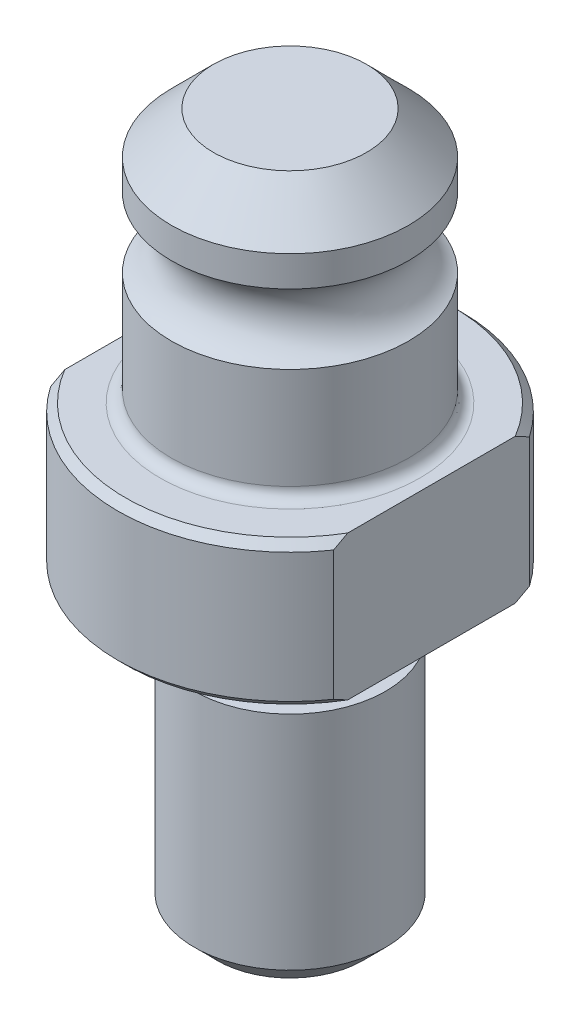
ISO-10303-21;
HEADER;
FILE_DESCRIPTION(('STEP AP214'),'2;1');
FILE_NAME('part.step','',(''),(''),'','','');
FILE_SCHEMA(('AUTOMOTIVE_DESIGN { 1 0 10303 214 1 1 1 1 }'));
ENDSEC;
DATA;
#1=APPLICATION_CONTEXT('core data for automotive mechanical design processes');
#2=APPLICATION_PROTOCOL_DEFINITION('international standard','automotive_design',2000,#1);
#3=PRODUCT_CONTEXT('',#1,'mechanical');
#4=PRODUCT('Part','Part','',(#3));
#5=PRODUCT_RELATED_PRODUCT_CATEGORY('part','',(#4));
#6=PRODUCT_DEFINITION_FORMATION('','',#4);
#7=PRODUCT_DEFINITION_CONTEXT('part definition',#1,'design');
#8=PRODUCT_DEFINITION('design','',#6,#7);
#9=PRODUCT_DEFINITION_SHAPE('','',#8);
#10=(LENGTH_UNIT() NAMED_UNIT(*) SI_UNIT(.MILLI.,.METRE.));
#11=(NAMED_UNIT(*) PLANE_ANGLE_UNIT() SI_UNIT($,.RADIAN.));
#12=(NAMED_UNIT(*) SI_UNIT($,.STERADIAN.) SOLID_ANGLE_UNIT());
#13=UNCERTAINTY_MEASURE_WITH_UNIT(LENGTH_MEASURE(1.E-05),#10,'distance_accuracy_value','');
#14=(GEOMETRIC_REPRESENTATION_CONTEXT(3) GLOBAL_UNCERTAINTY_ASSIGNED_CONTEXT((#13)) GLOBAL_UNIT_ASSIGNED_CONTEXT((#10,
#11,#12)) REPRESENTATION_CONTEXT('',''));
#15=CARTESIAN_POINT('',(0.,0.,0.));
#16=DIRECTION('',(0.,0.,1.));
#17=DIRECTION('',(1.,0.,0.));
#18=AXIS2_PLACEMENT_3D('',#15,#16,#17);
#19=CARTESIAN_POINT('',(0.,-20.066,0.));
#20=DIRECTION('',(0.,1.,0.));
#21=DIRECTION('',(-1.,0.,0.));
#22=AXIS2_PLACEMENT_3D('',#19,#20,#21);
#23=CYLINDRICAL_SURFACE('',#22,11.43);
#24=DIRECTION('',(0.,1.,0.));
#25=VECTOR('',#24,1.);
#26=CARTESIAN_POINT('',(-9.398,-20.066,-6.50557422523177));
#27=LINE('',#26,#25);
#28=CARTESIAN_POINT('',(-9.398,0.507999999999992,-6.50557422523177));
#29=VERTEX_POINT('',#28);
#30=CARTESIAN_POINT('',(-9.398,9.09319999999999,-6.50557422523177));
#31=VERTEX_POINT('',#30);
#32=EDGE_CURVE('E178',#29,#31,#27,.T.);
#33=ORIENTED_EDGE('',*,*,#32,.T.);
#34=CARTESIAN_POINT('',(0.,9.09319999999999,0.));
#35=DIRECTION('',(0.,1.,0.));
#36=DIRECTION('',(-1.,0.,0.));
#37=AXIS2_PLACEMENT_3D('',#34,#35,#36);
#38=CIRCLE('',#37,11.43);
#39=CARTESIAN_POINT('',(9.398,9.09319999999999,-6.50557422523177));
#40=VERTEX_POINT('',#39);
#41=EDGE_CURVE('E196',#31,#40,#38,.F.);
#42=ORIENTED_EDGE('',*,*,#41,.T.);
#43=DIRECTION('',(0.,1.,0.));
#44=VECTOR('',#43,1.);
#45=CARTESIAN_POINT('',(9.398,-20.066,-6.50557422523177));
#46=LINE('',#45,#44);
#47=CARTESIAN_POINT('',(9.398,0.507999999999991,-6.50557422523177));
#48=VERTEX_POINT('',#47);
#49=EDGE_CURVE('E158',#48,#40,#46,.T.);
#50=ORIENTED_EDGE('',*,*,#49,.F.);
#51=CARTESIAN_POINT('',(0.,0.507999999999991,0.));
#52=DIRECTION('',(0.,-1.,0.));
#53=DIRECTION('',(1.,0.,0.));
#54=AXIS2_PLACEMENT_3D('',#51,#52,#53);
#55=CIRCLE('',#54,11.43);
#56=EDGE_CURVE('E199',#48,#29,#55,.F.);
#57=ORIENTED_EDGE('',*,*,#56,.T.);
#58=EDGE_LOOP('',(#33,#42,#50,#57));
#59=FACE_BOUND('',#58,.T.);
#60=ADVANCED_FACE('F31',(#59),#23,.T.);
#61=CARTESIAN_POINT('',(0.,0.507999999999991,0.));
#62=DIRECTION('',(0.,1.,0.));
#63=DIRECTION('',(-1.,0.,0.));
#64=AXIS2_PLACEMENT_3D('',#61,#62,#63);
#65=CONICAL_SURFACE('',#64,11.43,0.785398163397452);
#66=CARTESIAN_POINT('',(-9.398,6.20515109767811,-14.3184112499501));
#67=CARTESIAN_POINT('',(-9.398,6.00960417319241,-14.08449094914));
#68=CARTESIAN_POINT('',(-9.398,5.81489107595651,-13.8498698562992));
#69=CARTESIAN_POINT('',(-9.398,5.42739573795378,-13.3790258088407));
#70=CARTESIAN_POINT('',(-9.398,5.23461356289662,-13.1428028001653));
#71=CARTESIAN_POINT('',(-9.398,4.8511079654793,-12.6683866504166));
#72=CARTESIAN_POINT('',(-9.398,4.66038625512613,-12.4301921239068));
#73=CARTESIAN_POINT('',(-9.398,4.28149353308532,-11.9517843820013));
#74=CARTESIAN_POINT('',(-9.398,4.09332250005509,-11.7115711835239));
#75=CARTESIAN_POINT('',(-9.398,3.71527593658798,-11.2228351276237));
#76=CARTESIAN_POINT('',(-9.398,3.52547501990412,-10.9742544794526));
#77=CARTESIAN_POINT('',(-9.398,3.14951118909463,-10.4743575593104));
#78=CARTESIAN_POINT('',(-9.398,2.9633482309098,-10.2230413205276));
#79=CARTESIAN_POINT('',(-9.398,2.59536564911707,-9.71734764233813));
#80=CARTESIAN_POINT('',(-9.398,2.41354486426719,-9.46297104936886));
#81=CARTESIAN_POINT('',(-9.398,2.05501231016234,-8.9506393803597));
#82=CARTESIAN_POINT('',(-9.398,1.87830044330885,-8.69268437281977));
#83=CARTESIAN_POINT('',(-9.398,1.56456912546989,-8.22291682969296));
#84=CARTESIAN_POINT('',(-9.398,1.42647837425502,-8.0118204649176));
#85=CARTESIAN_POINT('',(-9.398,1.15495905884282,-7.58665310777869));
#86=CARTESIAN_POINT('',(-9.398,1.02153034058384,-7.37258221403886));
#87=CARTESIAN_POINT('',(-9.398,0.760058312603229,-6.94100654824664));
#88=CARTESIAN_POINT('',(-9.398,0.632017983088299,-6.72349996511674));
#89=CARTESIAN_POINT('',(-9.398,0.382380030476805,-6.28483366169819));
#90=CARTESIAN_POINT('',(-9.398,0.260781926304037,-6.06367421581125));
#91=CARTESIAN_POINT('',(-9.398,0.0260310883673295,-5.61893125793485));
#92=CARTESIAN_POINT('',(-9.398,-0.087176390474475,-5.39537686735325));
#93=CARTESIAN_POINT('',(-9.398,-0.304724231527306,-4.94401149584156));
#94=CARTESIAN_POINT('',(-9.398,-0.409064064653849,-4.71620026191648));
#95=CARTESIAN_POINT('',(-9.398,-0.706245204543078,-4.02633645713959));
#96=CARTESIAN_POINT('',(-9.398,-0.88357135735487,-3.55725866273005));
#97=CARTESIAN_POINT('',(-9.398,-1.11925927572375,-2.80027581270136));
#98=CARTESIAN_POINT('',(-9.398,-1.19642089442063,-2.51819409135615));
#99=CARTESIAN_POINT('',(-9.398,-1.32808067194305,-1.94872920659047));
#100=CARTESIAN_POINT('',(-9.398,-1.38258192179547,-1.6613467718119));
#101=CARTESIAN_POINT('',(-9.398,-1.46601585472433,-1.08377451088637));
#102=CARTESIAN_POINT('',(-9.398,-1.49502921597881,-0.793596503905189));
#103=CARTESIAN_POINT('',(-9.398,-1.52610154719579,-0.211784175224561));
#104=CARTESIAN_POINT('',(-9.398,-1.5281614920139,0.0798500934229162));
#105=CARTESIAN_POINT('',(-9.398,-1.50520012960554,0.662106927066459));
#106=CARTESIAN_POINT('',(-9.398,-1.48017181460068,0.952729210743102));
#107=CARTESIAN_POINT('',(-9.398,-1.40449019133301,1.5305913863711));
#108=CARTESIAN_POINT('',(-9.398,-1.35383429003577,1.81783093304246));
#109=CARTESIAN_POINT('',(-9.398,-1.22928523711488,2.38834337894052));
#110=CARTESIAN_POINT('',(-9.398,-1.15530115653646,2.67159614677237));
#111=CARTESIAN_POINT('',(-9.398,-0.987366205247122,3.23203762715996));
#112=CARTESIAN_POINT('',(-9.398,-0.893415412990204,3.50922636353801));
#113=CARTESIAN_POINT('',(-9.398,-0.666567865395263,4.11670181718503));
#114=CARTESIAN_POINT('',(-9.398,-0.529643444923908,4.44547461397256));
#115=CARTESIAN_POINT('',(-9.398,-0.236065659034477,5.09416537719402));
#116=CARTESIAN_POINT('',(-9.398,-0.0794024617509457,5.41407883325828));
#117=CARTESIAN_POINT('',(-9.398,0.249748723060986,6.04636729869469));
#118=CARTESIAN_POINT('',(-9.398,0.422266185337797,6.35872684553366));
#119=CARTESIAN_POINT('',(-9.398,0.779573669101482,6.97623166997071));
#120=CARTESIAN_POINT('',(-9.398,0.964361731892766,7.28137808847071));
#121=CARTESIAN_POINT('',(-9.398,1.34493065893927,7.88740298676278));
#122=CARTESIAN_POINT('',(-9.398,1.54077367051226,8.18824225449228));
#123=CARTESIAN_POINT('',(-9.398,1.9404315326033,8.7845713773197));
#124=CARTESIAN_POINT('',(-9.398,2.14424663514559,9.0800610628669));
#125=CARTESIAN_POINT('',(-9.398,2.55813820898903,9.66616342017784));
#126=CARTESIAN_POINT('',(-9.398,2.76820817435713,9.95678069963848));
#127=CARTESIAN_POINT('',(-9.398,3.19364561900608,10.5340926145833));
#128=CARTESIAN_POINT('',(-9.398,3.40901297979698,10.8207873375829));
#129=CARTESIAN_POINT('',(-9.398,3.83603479433634,11.380184094233));
#130=CARTESIAN_POINT('',(-9.398,4.04752824782697,11.6530092675254));
#131=CARTESIAN_POINT('',(-9.398,4.47398108014071,12.1959852761766));
#132=CARTESIAN_POINT('',(-9.398,4.6889408592987,12.4661357967328));
#133=CARTESIAN_POINT('',(-9.398,5.11939580741512,13.0011138143318));
#134=CARTESIAN_POINT('',(-9.398,5.33485890307148,13.2659671556663));
#135=CARTESIAN_POINT('',(-9.398,5.76825166907075,13.7936425802487));
#136=CARTESIAN_POINT('',(-9.398,5.98618130385707,14.0564646926862));
#137=CARTESIAN_POINT('',(-9.398,6.20515109767811,14.3184112499501));
#138=B_SPLINE_CURVE_WITH_KNOTS('',3,(#66,#67,#68,#69,#70,#71,#72,#73,#74,#75,#76,#77,#78,#79,
#80,#81,#82,#83,#84,#85,#86,#87,#88,#89,#90,#91,#92,#93,#94,#95,#96,#97,#98,#99,#100,#101,#102,
#103,#104,#105,#106,#107,#108,#109,#110,#111,#112,#113,#114,#115,#116,#117,#118,#119,#120,#121,
#122,#123,#124,#125,#126,#127,#128,#129,#130,#131,#132,#133,#134,#135,#136,#137),.UNSPECIFIED.,
.F.,.F.,(4,2,2,2,2,2,2,2,2,2,2,2,2,2,2,2,2,2,2,2,2,2,2,2,2,2,2,2,2,2,2,2,2,2,2,4),(0.,
0.914669348864225,1.82936971906776,2.74477924736894,3.66018111132055,4.59842273117614,
5.53665298096529,6.47462944133687,7.41258797116341,8.1692907672537,8.92596853362805,
9.68305944557016,10.4400937414729,11.1916499993646,11.9432510671212,13.4444271153923,
14.3210100831176,15.1974734397647,16.0711523786463,16.9447997180765,17.8186731255787,
18.6926349704834,19.5700463690559,20.447454320132,21.5150460059722,22.5831715761537,
23.6533247053991,24.7233074201033,25.8000590624781,26.8768447720971,27.9525471178122,
29.0282254245012,30.0637937125213,31.0994824699716,32.1237444894033,33.1479917622709),.UNSPECIFIED.);
#139=CARTESIAN_POINT('',(-9.398,0.,-5.56486118425249));
#140=VERTEX_POINT('',#139);
#141=EDGE_CURVE('E179',#29,#140,#138,.T.);
#142=ORIENTED_EDGE('',*,*,#141,.F.);
#143=ORIENTED_EDGE('',*,*,#56,.F.);
#144=CARTESIAN_POINT('',(9.398,6.20515109767811,14.3184112499501));
#145=CARTESIAN_POINT('',(9.398,6.00960417319241,14.08449094914));
#146=CARTESIAN_POINT('',(9.398,5.81489107595651,13.8498698562992));
#147=CARTESIAN_POINT('',(9.398,5.42739573795378,13.3790258088408));
#148=CARTESIAN_POINT('',(9.398,5.23461356289662,13.1428028001653));
#149=CARTESIAN_POINT('',(9.398,4.8511079654793,12.6683866504166));
#150=CARTESIAN_POINT('',(9.398,4.66038625512613,12.4301921239068));
#151=CARTESIAN_POINT('',(9.398,4.28149353308532,11.9517843820013));
#152=CARTESIAN_POINT('',(9.398,4.09332250005509,11.7115711835239));
#153=CARTESIAN_POINT('',(9.398,3.71527593658798,11.2228351276237));
#154=CARTESIAN_POINT('',(9.398,3.52547501990412,10.9742544794526));
#155=CARTESIAN_POINT('',(9.398,3.14951118909463,10.4743575593104));
#156=CARTESIAN_POINT('',(9.398,2.9633482309098,10.2230413205276));
#157=CARTESIAN_POINT('',(9.398,2.59536564911707,9.71734764233813));
#158=CARTESIAN_POINT('',(9.398,2.41354486426719,9.46297104936886));
#159=CARTESIAN_POINT('',(9.398,2.05501231016234,8.95063938035971));
#160=CARTESIAN_POINT('',(9.398,1.87830044330885,8.69268437281978));
#161=CARTESIAN_POINT('',(9.398,1.56456912546989,8.22291682969296));
#162=CARTESIAN_POINT('',(9.398,1.42647837425502,8.0118204649176));
#163=CARTESIAN_POINT('',(9.398,1.15495905884282,7.58665310777869));
#164=CARTESIAN_POINT('',(9.398,1.02153034058384,7.37258221403886));
#165=CARTESIAN_POINT('',(9.398,0.760058312603227,6.94100654824664));
#166=CARTESIAN_POINT('',(9.398,0.632017983088297,6.72349996511674));
#167=CARTESIAN_POINT('',(9.398,0.382380030476802,6.28483366169819));
#168=CARTESIAN_POINT('',(9.398,0.260781926304033,6.06367421581125));
#169=CARTESIAN_POINT('',(9.398,0.0260310883673268,5.61893125793485));
#170=CARTESIAN_POINT('',(9.398,-0.087176390474476,5.39537686735325));
#171=CARTESIAN_POINT('',(9.398,-0.304724231527307,4.94401149584156));
#172=CARTESIAN_POINT('',(9.398,-0.409064064653852,4.71620026191648));
#173=CARTESIAN_POINT('',(9.398,-0.706245204543083,4.02633645713959));
#174=CARTESIAN_POINT('',(9.398,-0.883571357354872,3.55725866273005));
#175=CARTESIAN_POINT('',(9.398,-1.11925927572375,2.80027581270135));
#176=CARTESIAN_POINT('',(9.398,-1.19642089442063,2.51819409135615));
#177=CARTESIAN_POINT('',(9.398,-1.32808067194305,1.94872920659046));
#178=CARTESIAN_POINT('',(9.398,-1.38258192179547,1.6613467718119));
#179=CARTESIAN_POINT('',(9.398,-1.46601585472434,1.08377451088637));
#180=CARTESIAN_POINT('',(9.398,-1.49502921597882,0.793596503905186));
#181=CARTESIAN_POINT('',(9.398,-1.52610154719579,0.211784175224558));
#182=CARTESIAN_POINT('',(9.398,-1.5281614920139,-0.079850093422919));
#183=CARTESIAN_POINT('',(9.398,-1.50520012960554,-0.662106927066461));
#184=CARTESIAN_POINT('',(9.398,-1.48017181460068,-0.952729210743103));
#185=CARTESIAN_POINT('',(9.398,-1.40449019133301,-1.5305913863711));
#186=CARTESIAN_POINT('',(9.398,-1.35383429003577,-1.81783093304246));
#187=CARTESIAN_POINT('',(9.398,-1.22928523711488,-2.38834337894052));
#188=CARTESIAN_POINT('',(9.398,-1.15530115653647,-2.67159614677237));
#189=CARTESIAN_POINT('',(9.398,-0.987366205247123,-3.23203762715996));
#190=CARTESIAN_POINT('',(9.398,-0.893415412990204,-3.50922636353801));
#191=CARTESIAN_POINT('',(9.398,-0.666567865395263,-4.11670181718503));
#192=CARTESIAN_POINT('',(9.398,-0.529643444923908,-4.44547461397257));
#193=CARTESIAN_POINT('',(9.398,-0.236065659034477,-5.09416537719403));
#194=CARTESIAN_POINT('',(9.398,-0.079402461750945,-5.41407883325829));
#195=CARTESIAN_POINT('',(9.398,0.249748723060989,-6.04636729869469));
#196=CARTESIAN_POINT('',(9.398,0.422266185337801,-6.35872684553367));
#197=CARTESIAN_POINT('',(9.398,0.779573669101487,-6.97623166997072));
#198=CARTESIAN_POINT('',(9.398,0.96436173189277,-7.28137808847072));
#199=CARTESIAN_POINT('',(9.398,1.34493065893928,-7.88740298676279));
#200=CARTESIAN_POINT('',(9.398,1.54077367051226,-8.18824225449229));
#201=CARTESIAN_POINT('',(9.398,1.94043153260331,-8.78457137731971));
#202=CARTESIAN_POINT('',(9.398,2.14424663514559,-9.08006106286691));
#203=CARTESIAN_POINT('',(9.398,2.55813820898904,-9.66616342017786));
#204=CARTESIAN_POINT('',(9.398,2.76820817435714,-9.95678069963849));
#205=CARTESIAN_POINT('',(9.398,3.19364561900609,-10.5340926145834));
#206=CARTESIAN_POINT('',(9.398,3.409012979797,-10.8207873375829));
#207=CARTESIAN_POINT('',(9.398,3.83603479433635,-11.380184094233));
#208=CARTESIAN_POINT('',(9.398,4.04752824782698,-11.6530092675254));
#209=CARTESIAN_POINT('',(9.398,4.47398108014072,-12.1959852761766));
#210=CARTESIAN_POINT('',(9.398,4.68894085929871,-12.4661357967328));
#211=CARTESIAN_POINT('',(9.398,5.11939580741512,-13.0011138143318));
#212=CARTESIAN_POINT('',(9.398,5.33485890307149,-13.2659671556663));
#213=CARTESIAN_POINT('',(9.398,5.76825166907074,-13.7936425802487));
#214=CARTESIAN_POINT('',(9.398,5.98618130385707,-14.0564646926862));
#215=CARTESIAN_POINT('',(9.398,6.20515109767811,-14.3184112499501));
#216=B_SPLINE_CURVE_WITH_KNOTS('',3,(#144,#145,#146,#147,#148,#149,#150,#151,#152,#153,#154,
#155,#156,#157,#158,#159,#160,#161,#162,#163,#164,#165,#166,#167,#168,#169,#170,#171,#172,#173,
#174,#175,#176,#177,#178,#179,#180,#181,#182,#183,#184,#185,#186,#187,#188,#189,#190,#191,#192,
#193,#194,#195,#196,#197,#198,#199,#200,#201,#202,#203,#204,#205,#206,#207,#208,#209,#210,#211,
#212,#213,#214,#215),.UNSPECIFIED.,.F.,.F.,(4,2,2,2,2,2,2,2,2,2,2,2,2,2,2,2,2,2,2,2,2,2,2,2,2,2,
2,2,2,2,2,2,2,2,2,4),(0.,0.914669348864223,1.82936971906776,2.74477924736894,3.66018111132055,
4.59842273117614,5.5366529809653,6.47462944133688,7.41258797116341,8.1692907672537,
8.92596853362805,9.68305944557017,10.4400937414729,11.1916499993646,11.9432510671212,
13.4444271153923,14.3210100831176,15.1974734397647,16.0711523786463,16.9447997180765,
17.8186731255787,18.6926349704834,19.5700463690559,20.447454320132,21.5150460059722,
22.5831715761537,23.6533247053991,24.7233074201033,25.8000590624781,26.8768447720972,
27.9525471178122,29.0282254245012,30.0637937125213,31.0994824699716,32.1237444894033,
33.1479917622709),.UNSPECIFIED.);
#217=CARTESIAN_POINT('',(9.398,0.,-5.5648611842525));
#218=VERTEX_POINT('',#217);
#219=EDGE_CURVE('E149',#218,#48,#216,.T.);
#220=ORIENTED_EDGE('',*,*,#219,.F.);
#221=CARTESIAN_POINT('',(0.,0.,0.));
#222=DIRECTION('',(0.,-1.,0.));
#223=DIRECTION('',(1.,0.,0.));
#224=AXIS2_PLACEMENT_3D('',#221,#222,#223);
#225=CIRCLE('',#224,10.922);
#226=EDGE_CURVE('E116',#140,#218,#225,.T.);
#227=ORIENTED_EDGE('',*,*,#226,.F.);
#228=EDGE_LOOP('',(#142,#143,#220,#227));
#229=FACE_BOUND('',#228,.T.);
#230=ADVANCED_FACE('F166',(#229),#65,.T.);
#231=CARTESIAN_POINT('',(0.,9.6012,0.));
#232=DIRECTION('',(0.,-1.,0.));
#233=DIRECTION('',(1.,0.,0.));
#234=AXIS2_PLACEMENT_3D('',#231,#232,#233);
#235=CONICAL_SURFACE('',#234,10.922,0.785398163397453);
#236=CARTESIAN_POINT('',(-9.398,3.39604890232189,14.3184112499501));
#237=CARTESIAN_POINT('',(-9.398,3.59159582680758,14.08449094914));
#238=CARTESIAN_POINT('',(-9.398,3.78630892404348,13.8498698562992));
#239=CARTESIAN_POINT('',(-9.398,4.17380426204621,13.3790258088407));
#240=CARTESIAN_POINT('',(-9.398,4.36658643710338,13.1428028001653));
#241=CARTESIAN_POINT('',(-9.398,4.75009203452069,12.6683866504166));
#242=CARTESIAN_POINT('',(-9.398,4.94081374487387,12.4301921239068));
#243=CARTESIAN_POINT('',(-9.398,5.31970646691468,11.9517843820013));
#244=CARTESIAN_POINT('',(-9.398,5.5078774999449,11.7115711835239));
#245=CARTESIAN_POINT('',(-9.398,5.88592406341201,11.2228351276237));
#246=CARTESIAN_POINT('',(-9.398,6.07572498009587,10.9742544794526));
#247=CARTESIAN_POINT('',(-9.398,6.45168881090536,10.4743575593104));
#248=CARTESIAN_POINT('',(-9.398,6.6378517690902,10.2230413205276));
#249=CARTESIAN_POINT('',(-9.398,7.00583435088292,9.71734764233812));
#250=CARTESIAN_POINT('',(-9.398,7.1876551357328,9.46297104936885));
#251=CARTESIAN_POINT('',(-9.398,7.54618768983765,8.9506393803597));
#252=CARTESIAN_POINT('',(-9.398,7.72289955669114,8.69268437281977));
#253=CARTESIAN_POINT('',(-9.398,8.0366308745301,8.22291682969295));
#254=CARTESIAN_POINT('',(-9.398,8.17472162574497,8.01182046491759));
#255=CARTESIAN_POINT('',(-9.398,8.44624094115716,7.58665310777868));
#256=CARTESIAN_POINT('',(-9.398,8.57966965941615,7.37258221403885));
#257=CARTESIAN_POINT('',(-9.398,8.84114168739676,6.94100654824664));
#258=CARTESIAN_POINT('',(-9.398,8.96918201691169,6.72349996511673));
#259=CARTESIAN_POINT('',(-9.398,9.21881996952318,6.28483366169818));
#260=CARTESIAN_POINT('',(-9.398,9.34041807369595,6.06367421581125));
#261=CARTESIAN_POINT('',(-9.398,9.57516891163265,5.61893125793484));
#262=CARTESIAN_POINT('',(-9.398,9.68837639047446,5.39537686735324));
#263=CARTESIAN_POINT('',(-9.398,9.90592423152729,4.94401149584155));
#264=CARTESIAN_POINT('',(-9.398,10.0102640646538,4.71620026191647));
#265=CARTESIAN_POINT('',(-9.398,10.3074452045431,4.02633645713958));
#266=CARTESIAN_POINT('',(-9.398,10.4847713573548,3.55725866273004));
#267=CARTESIAN_POINT('',(-9.398,10.7204592757237,2.80027581270134));
#268=CARTESIAN_POINT('',(-9.398,10.7976208944206,2.51819409135613));
#269=CARTESIAN_POINT('',(-9.398,10.929280671943,1.94872920659045));
#270=CARTESIAN_POINT('',(-9.398,10.9837819217954,1.66134677181189));
#271=CARTESIAN_POINT('',(-9.398,11.0672158547243,1.08377451088635));
#272=CARTESIAN_POINT('',(-9.398,11.0962292159788,0.793596503905169));
#273=CARTESIAN_POINT('',(-9.398,11.1273015471958,0.211784175224539));
#274=CARTESIAN_POINT('',(-9.398,11.1293614920139,-0.0798500934229388));
#275=CARTESIAN_POINT('',(-9.398,11.1064001296055,-0.662106927066483));
#276=CARTESIAN_POINT('',(-9.398,11.0813718146007,-0.952729210743125));
#277=CARTESIAN_POINT('',(-9.398,11.005690191333,-1.53059138637113));
#278=CARTESIAN_POINT('',(-9.398,10.9550342900357,-1.81783093304248));
#279=CARTESIAN_POINT('',(-9.398,10.8304852371148,-2.38834337894055));
#280=CARTESIAN_POINT('',(-9.398,10.7565011565364,-2.6715961467724));
#281=CARTESIAN_POINT('',(-9.398,10.5885662052471,-3.23203762715999));
#282=CARTESIAN_POINT('',(-9.398,10.4946154129902,-3.50922636353804));
#283=CARTESIAN_POINT('',(-9.398,10.2677678653952,-4.11670181718506));
#284=CARTESIAN_POINT('',(-9.398,10.1308434449239,-4.4454746139726));
#285=CARTESIAN_POINT('',(-9.398,9.83726565903443,-5.09416537719407));
#286=CARTESIAN_POINT('',(-9.398,9.6806024617509,-5.41407883325834));
#287=CARTESIAN_POINT('',(-9.398,9.35145127693896,-6.04636729869475));
#288=CARTESIAN_POINT('',(-9.398,9.17893381466214,-6.35872684553373));
#289=CARTESIAN_POINT('',(-9.398,8.82162633089846,-6.97623166997078));
#290=CARTESIAN_POINT('',(-9.398,8.63683826810717,-7.28137808847079));
#291=CARTESIAN_POINT('',(-9.398,8.25626934106066,-7.88740298676286));
#292=CARTESIAN_POINT('',(-9.398,8.06042632948767,-8.18824225449236));
#293=CARTESIAN_POINT('',(-9.398,7.66076846739662,-8.78457137731979));
#294=CARTESIAN_POINT('',(-9.398,7.45695336485433,-9.08006106286699));
#295=CARTESIAN_POINT('',(-9.398,7.04306179101088,-9.66616342017794));
#296=CARTESIAN_POINT('',(-9.398,6.83299182564279,-9.95678069963858));
#297=CARTESIAN_POINT('',(-9.398,6.40755438099382,-10.5340926145835));
#298=CARTESIAN_POINT('',(-9.398,6.19218702020292,-10.820787337583));
#299=CARTESIAN_POINT('',(-9.398,5.76516520566357,-11.3801840942331));
#300=CARTESIAN_POINT('',(-9.398,5.55367175217295,-11.6530092675255));
#301=CARTESIAN_POINT('',(-9.398,5.12721891985922,-12.1959852761767));
#302=CARTESIAN_POINT('',(-9.398,4.91225914070125,-12.4661357967329));
#303=CARTESIAN_POINT('',(-9.398,4.48180419258484,-13.0011138143318));
#304=CARTESIAN_POINT('',(-9.398,4.26634109692848,-13.2659671556664));
#305=CARTESIAN_POINT('',(-9.398,3.83294833092923,-13.7936425802488));
#306=CARTESIAN_POINT('',(-9.398,3.61501869614292,-14.0564646926862));
#307=CARTESIAN_POINT('',(-9.398,3.39604890232189,-14.3184112499501));
#308=B_SPLINE_CURVE_WITH_KNOTS('',3,(#236,#237,#238,#239,#240,#241,#242,#243,#244,#245,#246,
#247,#248,#249,#250,#251,#252,#253,#254,#255,#256,#257,#258,#259,#260,#261,#262,#263,#264,#265,
#266,#267,#268,#269,#270,#271,#272,#273,#274,#275,#276,#277,#278,#279,#280,#281,#282,#283,#284,
#285,#286,#287,#288,#289,#290,#291,#292,#293,#294,#295,#296,#297,#298,#299,#300,#301,#302,#303,
#304,#305,#306,#307),.UNSPECIFIED.,.F.,.F.,(4,2,2,2,2,2,2,2,2,2,2,2,2,2,2,2,2,2,2,2,2,2,2,2,2,2,
2,2,2,2,2,2,2,2,2,4),(0.,0.914669348864224,1.82936971906776,2.74477924736894,3.66018111132055,
4.59842273117614,5.5366529809653,6.47462944133688,7.41258797116341,8.16929076725369,
8.92596853362805,9.68305944557016,10.4400937414729,11.1916499993646,11.9432510671212,
13.4444271153923,14.3210100831176,15.1974734397647,16.0711523786463,16.9447997180766,
17.8186731255788,18.6926349704834,19.5700463690559,20.447454320132,21.5150460059722,
22.5831715761537,23.6533247053991,24.7233074201033,25.8000590624782,26.8768447720972,
27.9525471178123,29.0282254245013,30.0637937125214,31.0994824699716,32.1237444894033,
33.1479917622709),.UNSPECIFIED.);
#309=CARTESIAN_POINT('',(-9.398,9.09319999999999,6.50557422523177));
#310=VERTEX_POINT('',#309);
#311=CARTESIAN_POINT('',(-9.398,9.6012,5.56486118425246));
#312=VERTEX_POINT('',#311);
#313=EDGE_CURVE('E95',#310,#312,#308,.T.);
#314=ORIENTED_EDGE('',*,*,#313,.F.);
#315=CARTESIAN_POINT('',(9.398,9.09319999999999,6.50557422523177));
#316=VERTEX_POINT('',#315);
#317=EDGE_CURVE('E202',#316,#310,#38,.F.);
#318=ORIENTED_EDGE('',*,*,#317,.F.);
#319=CARTESIAN_POINT('',(9.398,3.39604890232189,-14.3184112499501));
#320=CARTESIAN_POINT('',(9.398,3.59159582680758,-14.08449094914));
#321=CARTESIAN_POINT('',(9.398,3.78630892404348,-13.8498698562992));
#322=CARTESIAN_POINT('',(9.398,4.17380426204621,-13.3790258088408));
#323=CARTESIAN_POINT('',(9.398,4.36658643710338,-13.1428028001653));
#324=CARTESIAN_POINT('',(9.398,4.75009203452069,-12.6683866504166));
#325=CARTESIAN_POINT('',(9.398,4.94081374487386,-12.4301921239068));
#326=CARTESIAN_POINT('',(9.398,5.31970646691467,-11.9517843820013));
#327=CARTESIAN_POINT('',(9.398,5.5078774999449,-11.7115711835239));
#328=CARTESIAN_POINT('',(9.398,5.88592406341201,-11.2228351276237));
#329=CARTESIAN_POINT('',(9.398,6.07572498009587,-10.9742544794526));
#330=CARTESIAN_POINT('',(9.398,6.45168881090536,-10.4743575593104));
#331=CARTESIAN_POINT('',(9.398,6.63785176909019,-10.2230413205276));
#332=CARTESIAN_POINT('',(9.398,7.00583435088292,-9.71734764233813));
#333=CARTESIAN_POINT('',(9.398,7.1876551357328,-9.46297104936886));
#334=CARTESIAN_POINT('',(9.398,7.54618768983765,-8.9506393803597));
#335=CARTESIAN_POINT('',(9.398,7.72289955669114,-8.69268437281977));
#336=CARTESIAN_POINT('',(9.398,8.0366308745301,-8.22291682969295));
#337=CARTESIAN_POINT('',(9.398,8.17472162574497,-8.01182046491759));
#338=CARTESIAN_POINT('',(9.398,8.44624094115716,-7.58665310777868));
#339=CARTESIAN_POINT('',(9.398,8.57966965941615,-7.37258221403886));
#340=CARTESIAN_POINT('',(9.398,8.84114168739676,-6.94100654824664));
#341=CARTESIAN_POINT('',(9.398,8.96918201691169,-6.72349996511673));
#342=CARTESIAN_POINT('',(9.398,9.21881996952318,-6.28483366169818));
#343=CARTESIAN_POINT('',(9.398,9.34041807369595,-6.06367421581125));
#344=CARTESIAN_POINT('',(9.398,9.57516891163266,-5.61893125793484));
#345=CARTESIAN_POINT('',(9.398,9.68837639047446,-5.39537686735324));
#346=CARTESIAN_POINT('',(9.398,9.90592423152729,-4.94401149584155));
#347=CARTESIAN_POINT('',(9.398,10.0102640646538,-4.71620026191647));
#348=CARTESIAN_POINT('',(9.398,10.3074452045431,-4.02633645713958));
#349=CARTESIAN_POINT('',(9.398,10.4847713573549,-3.55725866273004));
#350=CARTESIAN_POINT('',(9.398,10.7204592757237,-2.80027581270134));
#351=CARTESIAN_POINT('',(9.398,10.7976208944206,-2.51819409135614));
#352=CARTESIAN_POINT('',(9.398,10.929280671943,-1.94872920659045));
#353=CARTESIAN_POINT('',(9.398,10.9837819217954,-1.66134677181189));
#354=CARTESIAN_POINT('',(9.398,11.0672158547243,-1.08377451088635));
#355=CARTESIAN_POINT('',(9.398,11.0962292159788,-0.79359650390517));
#356=CARTESIAN_POINT('',(9.398,11.1273015471958,-0.21178417522454));
#357=CARTESIAN_POINT('',(9.398,11.1293614920139,0.0798500934229379));
#358=CARTESIAN_POINT('',(9.398,11.1064001296055,0.662106927066482));
#359=CARTESIAN_POINT('',(9.398,11.0813718146007,0.952729210743124));
#360=CARTESIAN_POINT('',(9.398,11.005690191333,1.53059138637113));
#361=CARTESIAN_POINT('',(9.398,10.9550342900357,1.81783093304248));
#362=CARTESIAN_POINT('',(9.398,10.8304852371149,2.38834337894055));
#363=CARTESIAN_POINT('',(9.398,10.7565011565364,2.6715961467724));
#364=CARTESIAN_POINT('',(9.398,10.5885662052471,3.23203762715999));
#365=CARTESIAN_POINT('',(9.398,10.4946154129902,3.50922636353804));
#366=CARTESIAN_POINT('',(9.398,10.2677678653952,4.11670181718506));
#367=CARTESIAN_POINT('',(9.398,10.1308434449239,4.4454746139726));
#368=CARTESIAN_POINT('',(9.398,9.83726565903444,5.09416537719407));
#369=CARTESIAN_POINT('',(9.398,9.6806024617509,5.41407883325834));
#370=CARTESIAN_POINT('',(9.398,9.35145127693897,6.04636729869474));
#371=CARTESIAN_POINT('',(9.398,9.17893381466215,6.35872684553372));
#372=CARTESIAN_POINT('',(9.398,8.82162633089846,6.97623166997077));
#373=CARTESIAN_POINT('',(9.398,8.63683826810717,7.28137808847078));
#374=CARTESIAN_POINT('',(9.398,8.25626934106066,7.88740298676285));
#375=CARTESIAN_POINT('',(9.398,8.06042632948768,8.18824225449236));
#376=CARTESIAN_POINT('',(9.398,7.66076846739662,8.78457137731978));
#377=CARTESIAN_POINT('',(9.398,7.45695336485434,9.08006106286699));
#378=CARTESIAN_POINT('',(9.398,7.04306179101088,9.66616342017794));
#379=CARTESIAN_POINT('',(9.398,6.83299182564279,9.95678069963858));
#380=CARTESIAN_POINT('',(9.398,6.40755438099383,10.5340926145835));
#381=CARTESIAN_POINT('',(9.398,6.19218702020292,10.820787337583));
#382=CARTESIAN_POINT('',(9.398,5.76516520566357,11.3801840942331));
#383=CARTESIAN_POINT('',(9.398,5.55367175217295,11.6530092675255));
#384=CARTESIAN_POINT('',(9.398,5.12721891985922,12.1959852761767));
#385=CARTESIAN_POINT('',(9.398,4.91225914070125,12.4661357967329));
#386=CARTESIAN_POINT('',(9.398,4.48180419258484,13.0011138143318));
#387=CARTESIAN_POINT('',(9.398,4.26634109692848,13.2659671556664));
#388=CARTESIAN_POINT('',(9.398,3.83294833092923,13.7936425802488));
#389=CARTESIAN_POINT('',(9.398,3.61501869614292,14.0564646926862));
#390=CARTESIAN_POINT('',(9.398,3.39604890232189,14.3184112499501));
#391=B_SPLINE_CURVE_WITH_KNOTS('',3,(#319,#320,#321,#322,#323,#324,#325,#326,#327,#328,#329,
#330,#331,#332,#333,#334,#335,#336,#337,#338,#339,#340,#341,#342,#343,#344,#345,#346,#347,#348,
#349,#350,#351,#352,#353,#354,#355,#356,#357,#358,#359,#360,#361,#362,#363,#364,#365,#366,#367,
#368,#369,#370,#371,#372,#373,#374,#375,#376,#377,#378,#379,#380,#381,#382,#383,#384,#385,#386,
#387,#388,#389,#390),.UNSPECIFIED.,.F.,.F.,(4,2,2,2,2,2,2,2,2,2,2,2,2,2,2,2,2,2,2,2,2,2,2,2,2,2,
2,2,2,2,2,2,2,2,2,4),(0.,0.914669348864224,1.82936971906776,2.74477924736894,3.66018111132055,
4.59842273117614,5.5366529809653,6.47462944133688,7.41258797116341,8.1692907672537,
8.92596853362805,9.68305944557017,10.4400937414729,11.1916499993646,11.9432510671212,
13.4444271153923,14.3210100831176,15.1974734397647,16.0711523786463,16.9447997180766,
17.8186731255788,18.6926349704834,19.5700463690559,20.447454320132,21.5150460059722,
22.5831715761537,23.6533247053991,24.7233074201033,25.8000590624782,26.8768447720972,
27.9525471178123,29.0282254245013,30.0637937125214,31.0994824699716,32.1237444894033,
33.1479917622709),.UNSPECIFIED.);
#392=CARTESIAN_POINT('',(9.398,9.6012,5.56486118425246));
#393=VERTEX_POINT('',#392);
#394=EDGE_CURVE('E111',#393,#316,#391,.T.);
#395=ORIENTED_EDGE('',*,*,#394,.F.);
#396=CARTESIAN_POINT('',(0.,9.6012,0.));
#397=DIRECTION('',(0.,1.,0.));
#398=DIRECTION('',(-1.,0.,0.));
#399=AXIS2_PLACEMENT_3D('',#396,#397,#398);
#400=CIRCLE('',#399,10.922);
#401=EDGE_CURVE('E53',#312,#393,#400,.T.);
#402=ORIENTED_EDGE('',*,*,#401,.F.);
#403=EDGE_LOOP('',(#314,#318,#395,#402));
#404=FACE_BOUND('',#403,.T.);
#405=ADVANCED_FACE('F110',(#404),#235,.T.);
#406=CARTESIAN_POINT('',(0.,-20.066,0.));
#407=DIRECTION('',(0.,-1.,0.));
#408=DIRECTION('',(1.,0.,0.));
#409=AXIS2_PLACEMENT_3D('',#406,#407,#408);
#410=PLANE('',#409);
#411=CARTESIAN_POINT('',(0.,-20.066,0.));
#412=DIRECTION('',(0.,-1.,0.));
#413=DIRECTION('',(1.,0.,0.));
#414=AXIS2_PLACEMENT_3D('',#411,#412,#413);
#415=CIRCLE('',#414,4.826);
#416=CARTESIAN_POINT('',(4.826,-20.066,0.));
#417=VERTEX_POINT('',#416);
#418=EDGE_CURVE('E122',#417,#417,#415,.T.);
#419=ORIENTED_EDGE('',*,*,#418,.T.);
#420=EDGE_LOOP('',(#419));
#421=FACE_BOUND('',#420,.T.);
#422=ADVANCED_FACE('F167',(#421),#410,.T.);
#423=CARTESIAN_POINT('',(0.,-20.066,0.));
#424=DIRECTION('',(0.,1.,0.));
#425=DIRECTION('',(-1.,0.,0.));
#426=AXIS2_PLACEMENT_3D('',#423,#424,#425);
#427=CYLINDRICAL_SURFACE('',#426,6.35);
#428=CARTESIAN_POINT('',(0.,-18.542,0.));
#429=DIRECTION('',(0.,-1.,0.));
#430=DIRECTION('',(1.,0.,0.));
#431=AXIS2_PLACEMENT_3D('',#428,#429,#430);
#432=CIRCLE('',#431,6.35);
#433=CARTESIAN_POINT('',(6.35,-18.542,0.));
#434=VERTEX_POINT('',#433);
#435=EDGE_CURVE('E114',#434,#434,#432,.F.);
#436=ORIENTED_EDGE('',*,*,#435,.T.);
#437=EDGE_LOOP('',(#436));
#438=FACE_BOUND('',#437,.T.);
#439=CARTESIAN_POINT('',(0.,-3.81,0.));
#440=DIRECTION('',(0.,1.,0.));
#441=DIRECTION('',(-1.,0.,0.));
#442=AXIS2_PLACEMENT_3D('',#439,#440,#441);
#443=CIRCLE('',#442,6.35);
#444=CARTESIAN_POINT('',(-6.35,-3.81,0.));
#445=VERTEX_POINT('',#444);
#446=EDGE_CURVE('E205',#445,#445,#443,.T.);
#447=ORIENTED_EDGE('',*,*,#446,.F.);
#448=EDGE_LOOP('',(#447));
#449=FACE_BOUND('',#448,.T.);
#450=ADVANCED_FACE('F261',(#438,#449),#427,.T.);
#451=CARTESIAN_POINT('',(-6.35,-3.81,0.));
#452=DIRECTION('',(0.,1.,0.));
#453=DIRECTION('',(-1.,0.,0.));
#454=AXIS2_PLACEMENT_3D('',#451,#452,#453);
#455=PLANE('',#454);
#456=ORIENTED_EDGE('',*,*,#446,.T.);
#457=EDGE_LOOP('',(#456));
#458=FACE_BOUND('',#457,.T.);
#459=CARTESIAN_POINT('',(0.,-3.81,0.));
#460=DIRECTION('',(0.,1.,0.));
#461=DIRECTION('',(-1.,0.,0.));
#462=AXIS2_PLACEMENT_3D('',#459,#460,#461);
#463=CIRCLE('',#462,5.1943);
#464=CARTESIAN_POINT('',(-5.1943,-3.81,0.));
#465=VERTEX_POINT('',#464);
#466=EDGE_CURVE('E208',#465,#465,#463,.T.);
#467=ORIENTED_EDGE('',*,*,#466,.F.);
#468=EDGE_LOOP('',(#467));
#469=FACE_BOUND('',#468,.T.);
#470=ADVANCED_FACE('F276',(#458,#469),#455,.T.);
#471=CARTESIAN_POINT('',(0.,-20.066,0.));
#472=DIRECTION('',(0.,1.,0.));
#473=DIRECTION('',(-1.,0.,0.));
#474=AXIS2_PLACEMENT_3D('',#471,#472,#473);
#475=CYLINDRICAL_SURFACE('',#474,5.1943);
#476=ORIENTED_EDGE('',*,*,#466,.T.);
#477=EDGE_LOOP('',(#476));
#478=FACE_BOUND('',#477,.T.);
#479=CARTESIAN_POINT('',(0.,-1.27000000000001,0.));
#480=DIRECTION('',(0.,1.,0.));
#481=DIRECTION('',(-1.,0.,0.));
#482=AXIS2_PLACEMENT_3D('',#479,#480,#481);
#483=CIRCLE('',#482,5.1943);
#484=CARTESIAN_POINT('',(-5.1943,-1.27000000000001,0.));
#485=VERTEX_POINT('',#484);
#486=EDGE_CURVE('E211',#485,#485,#483,.T.);
#487=ORIENTED_EDGE('',*,*,#486,.F.);
#488=EDGE_LOOP('',(#487));
#489=FACE_BOUND('',#488,.T.);
#490=ADVANCED_FACE('F281',(#478,#489),#475,.T.);
#491=CARTESIAN_POINT('',(0.,-1.27,0.));
#492=DIRECTION('',(0.,1.,0.));
#493=DIRECTION('',(-1.,0.,0.));
#494=AXIS2_PLACEMENT_3D('',#491,#492,#493);
#495=TOROIDAL_SURFACE('',#494,6.4643,1.27);
#496=ORIENTED_EDGE('',*,*,#486,.T.);
#497=EDGE_LOOP('',(#496));
#498=FACE_BOUND('',#497,.T.);
#499=CARTESIAN_POINT('',(0.,0.,0.));
#500=DIRECTION('',(0.,1.,0.));
#501=DIRECTION('',(-1.,0.,0.));
#502=AXIS2_PLACEMENT_3D('',#499,#500,#501);
#503=CIRCLE('',#502,6.46430000000001);
#504=CARTESIAN_POINT('',(-6.46430000000001,0.,0.));
#505=VERTEX_POINT('',#504);
#506=EDGE_CURVE('E214',#505,#505,#503,.T.);
#507=ORIENTED_EDGE('',*,*,#506,.F.);
#508=EDGE_LOOP('',(#507));
#509=FACE_BOUND('',#508,.T.);
#510=ADVANCED_FACE('F249',(#498,#509),#495,.F.);
#511=CARTESIAN_POINT('',(-6.46430000000001,0.,0.));
#512=DIRECTION('',(0.,-1.,0.));
#513=DIRECTION('',(1.,0.,0.));
#514=AXIS2_PLACEMENT_3D('',#511,#512,#513);
#515=PLANE('',#514);
#516=DIRECTION('',(0.,0.,1.));
#517=VECTOR('',#516,1.);
#518=CARTESIAN_POINT('',(-9.398,0.,0.));
#519=LINE('',#518,#517);
#520=CARTESIAN_POINT('',(-9.398,0.,5.56486118425249));
#521=VERTEX_POINT('',#520);
#522=EDGE_CURVE('E177',#140,#521,#519,.T.);
#523=ORIENTED_EDGE('',*,*,#522,.F.);
#524=ORIENTED_EDGE('',*,*,#226,.T.);
#525=DIRECTION('',(0.,0.,-1.));
#526=VECTOR('',#525,1.);
#527=CARTESIAN_POINT('',(9.398,0.,0.));
#528=LINE('',#527,#526);
#529=CARTESIAN_POINT('',(9.398,0.,5.5648611842525));
#530=VERTEX_POINT('',#529);
#531=EDGE_CURVE('E155',#530,#218,#528,.T.);
#532=ORIENTED_EDGE('',*,*,#531,.F.);
#533=EDGE_CURVE('E112',#530,#521,#225,.T.);
#534=ORIENTED_EDGE('',*,*,#533,.T.);
#535=EDGE_LOOP('',(#523,#524,#532,#534));
#536=FACE_BOUND('',#535,.T.);
#537=ORIENTED_EDGE('',*,*,#506,.T.);
#538=EDGE_LOOP('',(#537));
#539=FACE_BOUND('',#538,.T.);
#540=ADVANCED_FACE('F235',(#536,#539),#515,.T.);
#541=DIRECTION('',(0.,1.,0.));
#542=VECTOR('',#541,1.);
#543=CARTESIAN_POINT('',(-9.398,-20.066,6.50557422523177));
#544=LINE('',#543,#542);
#545=CARTESIAN_POINT('',(-9.398,0.507999999999992,6.50557422523177));
#546=VERTEX_POINT('',#545);
#547=EDGE_CURVE('E98',#546,#310,#544,.T.);
#548=ORIENTED_EDGE('',*,*,#547,.F.);
#549=CARTESIAN_POINT('',(9.398,0.507999999999991,6.50557422523177));
#550=VERTEX_POINT('',#549);
#551=EDGE_CURVE('E201',#546,#550,#55,.F.);
#552=ORIENTED_EDGE('',*,*,#551,.T.);
#553=DIRECTION('',(0.,1.,0.));
#554=VECTOR('',#553,1.);
#555=CARTESIAN_POINT('',(9.398,-20.066,6.50557422523177));
#556=LINE('',#555,#554);
#557=EDGE_CURVE('E156',#550,#316,#556,.T.);
#558=ORIENTED_EDGE('',*,*,#557,.T.);
#559=ORIENTED_EDGE('',*,*,#317,.T.);
#560=EDGE_LOOP('',(#548,#552,#558,#559));
#561=FACE_BOUND('',#560,.T.);
#562=ADVANCED_FACE('F239',(#561),#23,.T.);
#563=CARTESIAN_POINT('',(-11.43,9.6012,0.));
#564=DIRECTION('',(0.,1.,0.));
#565=DIRECTION('',(-1.,0.,0.));
#566=AXIS2_PLACEMENT_3D('',#563,#564,#565);
#567=PLANE('',#566);
#568=CARTESIAN_POINT('',(0.,9.6012,0.));
#569=DIRECTION('',(0.,1.,0.));
#570=DIRECTION('',(-1.,0.,0.));
#571=AXIS2_PLACEMENT_3D('',#568,#569,#570);
#572=CIRCLE('',#571,8.636);
#573=CARTESIAN_POINT('',(-8.636,9.6012,0.));
#574=VERTEX_POINT('',#573);
#575=EDGE_CURVE('E11',#574,#574,#572,.F.);
#576=ORIENTED_EDGE('',*,*,#575,.T.);
#577=EDGE_LOOP('',(#576));
#578=FACE_BOUND('',#577,.T.);
#579=DIRECTION('',(0.,0.,-1.));
#580=VECTOR('',#579,1.);
#581=CARTESIAN_POINT('',(-9.398,9.6012,-6.50557422523177));
#582=LINE('',#581,#580);
#583=CARTESIAN_POINT('',(-9.398,9.6012,-5.56486118425246));
#584=VERTEX_POINT('',#583);
#585=EDGE_CURVE('E46',#312,#584,#582,.T.);
#586=ORIENTED_EDGE('',*,*,#585,.F.);
#587=ORIENTED_EDGE('',*,*,#401,.T.);
#588=DIRECTION('',(0.,0.,1.));
#589=VECTOR('',#588,1.);
#590=CARTESIAN_POINT('',(9.398,9.6012,-6.50557422523177));
#591=LINE('',#590,#589);
#592=CARTESIAN_POINT('',(9.398,9.6012,-5.56486118425246));
#593=VERTEX_POINT('',#592);
#594=EDGE_CURVE('E182',#593,#393,#591,.T.);
#595=ORIENTED_EDGE('',*,*,#594,.F.);
#596=EDGE_CURVE('E107',#593,#584,#400,.T.);
#597=ORIENTED_EDGE('',*,*,#596,.T.);
#598=EDGE_LOOP('',(#586,#587,#595,#597));
#599=FACE_BOUND('',#598,.T.);
#600=ADVANCED_FACE('F105',(#578,#599),#567,.T.);
#601=CARTESIAN_POINT('',(0.,-20.066,0.));
#602=DIRECTION('',(0.,1.,0.));
#603=DIRECTION('',(-1.,0.,0.));
#604=AXIS2_PLACEMENT_3D('',#601,#602,#603);
#605=CYLINDRICAL_SURFACE('',#604,7.874);
#606=CARTESIAN_POINT('',(0.,10.3632,0.));
#607=DIRECTION('',(0.,1.,0.));
#608=DIRECTION('',(-1.,0.,0.));
#609=AXIS2_PLACEMENT_3D('',#606,#607,#608);
#610=CIRCLE('',#609,7.874);
#611=CARTESIAN_POINT('',(-7.874,10.3632,0.));
#612=VERTEX_POINT('',#611);
#613=EDGE_CURVE('E39',#612,#612,#610,.T.);
#614=ORIENTED_EDGE('',*,*,#613,.T.);
#615=EDGE_LOOP('',(#614));
#616=FACE_BOUND('',#615,.T.);
#617=CARTESIAN_POINT('',(0.,17.0942,0.));
#618=DIRECTION('',(0.,1.,0.));
#619=DIRECTION('',(-1.,0.,0.));
#620=AXIS2_PLACEMENT_3D('',#617,#618,#619);
#621=CIRCLE('',#620,7.874);
#622=CARTESIAN_POINT('',(-7.874,17.0942,0.));
#623=VERTEX_POINT('',#622);
#624=EDGE_CURVE('E217',#623,#623,#621,.T.);
#625=ORIENTED_EDGE('',*,*,#624,.F.);
#626=EDGE_LOOP('',(#625));
#627=FACE_BOUND('',#626,.T.);
#628=ADVANCED_FACE('F246',(#616,#627),#605,.T.);
#629=CARTESIAN_POINT('',(0.,19.4056,0.));
#630=DIRECTION('',(0.,1.,0.));
#631=DIRECTION('',(-1.,0.,0.));
#632=AXIS2_PLACEMENT_3D('',#629,#630,#631);
#633=TOROIDAL_SURFACE('',#632,8.86481166666668,2.51481166666667);
#634=ORIENTED_EDGE('',*,*,#624,.T.);
#635=EDGE_LOOP('',(#634));
#636=FACE_BOUND('',#635,.T.);
#637=CARTESIAN_POINT('',(0.,21.717,0.));
#638=DIRECTION('',(0.,1.,0.));
#639=DIRECTION('',(-1.,0.,0.));
#640=AXIS2_PLACEMENT_3D('',#637,#638,#639);
#641=CIRCLE('',#640,7.874);
#642=CARTESIAN_POINT('',(-7.874,21.717,0.));
#643=VERTEX_POINT('',#642);
#644=EDGE_CURVE('E220',#643,#643,#641,.T.);
#645=ORIENTED_EDGE('',*,*,#644,.F.);
#646=EDGE_LOOP('',(#645));
#647=FACE_BOUND('',#646,.T.);
#648=ADVANCED_FACE('F353',(#636,#647),#633,.F.);
#649=CARTESIAN_POINT('',(0.,-20.066,0.));
#650=DIRECTION('',(0.,1.,0.));
#651=DIRECTION('',(-1.,0.,0.));
#652=AXIS2_PLACEMENT_3D('',#649,#650,#651);
#653=CYLINDRICAL_SURFACE('',#652,7.874);
#654=ORIENTED_EDGE('',*,*,#644,.T.);
#655=EDGE_LOOP('',(#654));
#656=FACE_BOUND('',#655,.T.);
#657=CARTESIAN_POINT('',(0.,23.7489999999999,0.));
#658=DIRECTION('',(0.,1.,0.));
#659=DIRECTION('',(-1.,0.,0.));
#660=AXIS2_PLACEMENT_3D('',#657,#658,#659);
#661=CIRCLE('',#660,7.874);
#662=CARTESIAN_POINT('',(-7.874,23.7489999999999,0.));
#663=VERTEX_POINT('',#662);
#664=EDGE_CURVE('E223',#663,#663,#661,.T.);
#665=ORIENTED_EDGE('',*,*,#664,.F.);
#666=EDGE_LOOP('',(#665));
#667=FACE_BOUND('',#666,.T.);
#668=ADVANCED_FACE('F374',(#656,#667),#653,.T.);
#669=CARTESIAN_POINT('',(0.,26.543,0.));
#670=DIRECTION('',(0.,-1.,0.));
#671=DIRECTION('',(1.,0.,0.));
#672=AXIS2_PLACEMENT_3D('',#669,#670,#671);
#673=CONICAL_SURFACE('',#672,5.08000000000001,0.785398163397437);
#674=ORIENTED_EDGE('',*,*,#664,.T.);
#675=EDGE_LOOP('',(#674));
#676=FACE_BOUND('',#675,.T.);
#677=CARTESIAN_POINT('',(0.,26.543,0.));
#678=DIRECTION('',(0.,1.,0.));
#679=DIRECTION('',(-1.,0.,0.));
#680=AXIS2_PLACEMENT_3D('',#677,#678,#679);
#681=CIRCLE('',#680,5.08000000000001);
#682=CARTESIAN_POINT('',(-5.08000000000001,26.543,0.));
#683=VERTEX_POINT('',#682);
#684=EDGE_CURVE('E225',#683,#683,#681,.T.);
#685=ORIENTED_EDGE('',*,*,#684,.F.);
#686=EDGE_LOOP('',(#685));
#687=FACE_BOUND('',#686,.T.);
#688=ADVANCED_FACE('F380',(#676,#687),#673,.T.);
#689=CARTESIAN_POINT('',(-5.08000000000001,26.543,0.));
#690=DIRECTION('',(0.,1.,0.));
#691=DIRECTION('',(-1.,0.,0.));
#692=AXIS2_PLACEMENT_3D('',#689,#690,#691);
#693=PLANE('',#692);
#694=ORIENTED_EDGE('',*,*,#684,.T.);
#695=EDGE_LOOP('',(#694));
#696=FACE_BOUND('',#695,.T.);
#697=ADVANCED_FACE('F145',(#696),#693,.T.);
#698=EDGE_CURVE('E171',#521,#546,#138,.T.);
#699=ORIENTED_EDGE('',*,*,#698,.F.);
#700=ORIENTED_EDGE('',*,*,#533,.F.);
#701=EDGE_CURVE('E157',#550,#530,#216,.T.);
#702=ORIENTED_EDGE('',*,*,#701,.F.);
#703=ORIENTED_EDGE('',*,*,#551,.F.);
#704=EDGE_LOOP('',(#699,#700,#702,#703));
#705=FACE_BOUND('',#704,.T.);
#706=ADVANCED_FACE('F161',(#705),#65,.T.);
#707=EDGE_CURVE('E102',#584,#31,#308,.T.);
#708=ORIENTED_EDGE('',*,*,#707,.F.);
#709=ORIENTED_EDGE('',*,*,#596,.F.);
#710=EDGE_CURVE('E130',#40,#593,#391,.T.);
#711=ORIENTED_EDGE('',*,*,#710,.F.);
#712=ORIENTED_EDGE('',*,*,#41,.F.);
#713=EDGE_LOOP('',(#708,#709,#711,#712));
#714=FACE_BOUND('',#713,.T.);
#715=ADVANCED_FACE('F135',(#714),#235,.T.);
#716=CARTESIAN_POINT('',(0.,-18.542,0.));
#717=DIRECTION('',(0.,1.,0.));
#718=DIRECTION('',(-1.,0.,0.));
#719=AXIS2_PLACEMENT_3D('',#716,#717,#718);
#720=CONICAL_SURFACE('',#719,6.35,0.78539816339745);
#721=ORIENTED_EDGE('',*,*,#418,.F.);
#722=EDGE_LOOP('',(#721));
#723=FACE_BOUND('',#722,.T.);
#724=ORIENTED_EDGE('',*,*,#435,.F.);
#725=EDGE_LOOP('',(#724));
#726=FACE_BOUND('',#725,.T.);
#727=ADVANCED_FACE('F142',(#723,#726),#720,.T.);
#728=CARTESIAN_POINT('',(9.398,-20.066,-6.50557422523177));
#729=DIRECTION('',(-1.,0.,0.));
#730=DIRECTION('',(0.,-1.,0.));
#731=AXIS2_PLACEMENT_3D('',#728,#729,#730);
#732=PLANE('',#731);
#733=ORIENTED_EDGE('',*,*,#701,.T.);
#734=ORIENTED_EDGE('',*,*,#531,.T.);
#735=ORIENTED_EDGE('',*,*,#219,.T.);
#736=ORIENTED_EDGE('',*,*,#49,.T.);
#737=ORIENTED_EDGE('',*,*,#710,.T.);
#738=ORIENTED_EDGE('',*,*,#594,.T.);
#739=ORIENTED_EDGE('',*,*,#394,.T.);
#740=ORIENTED_EDGE('',*,*,#557,.F.);
#741=EDGE_LOOP('',(#733,#734,#735,#736,#737,#738,#739,#740));
#742=FACE_BOUND('',#741,.T.);
#743=ADVANCED_FACE('F138',(#742),#732,.F.);
#744=CARTESIAN_POINT('',(-9.398,-20.066,-6.50557422523177));
#745=DIRECTION('',(1.,0.,0.));
#746=DIRECTION('',(0.,1.,0.));
#747=AXIS2_PLACEMENT_3D('',#744,#745,#746);
#748=PLANE('',#747);
#749=ORIENTED_EDGE('',*,*,#141,.T.);
#750=ORIENTED_EDGE('',*,*,#522,.T.);
#751=ORIENTED_EDGE('',*,*,#698,.T.);
#752=ORIENTED_EDGE('',*,*,#547,.T.);
#753=ORIENTED_EDGE('',*,*,#313,.T.);
#754=ORIENTED_EDGE('',*,*,#585,.T.);
#755=ORIENTED_EDGE('',*,*,#707,.T.);
#756=ORIENTED_EDGE('',*,*,#32,.F.);
#757=EDGE_LOOP('',(#749,#750,#751,#752,#753,#754,#755,#756));
#758=FACE_BOUND('',#757,.T.);
#759=ADVANCED_FACE('F96',(#758),#748,.F.);
#760=CARTESIAN_POINT('',(0.,10.3632,0.));
#761=DIRECTION('',(0.,1.,0.));
#762=DIRECTION('',(-1.,0.,0.));
#763=AXIS2_PLACEMENT_3D('',#760,#761,#762);
#764=TOROIDAL_SURFACE('',#763,8.636,0.762);
#765=ORIENTED_EDGE('',*,*,#575,.F.);
#766=EDGE_LOOP('',(#765));
#767=FACE_BOUND('',#766,.T.);
#768=ORIENTED_EDGE('',*,*,#613,.F.);
#769=EDGE_LOOP('',(#768));
#770=FACE_BOUND('',#769,.T.);
#771=ADVANCED_FACE('F33',(#767,#770),#764,.F.);
#772=CLOSED_SHELL('',(#60,#230,#405,#422,#450,#470,#490,#510,#540,#562,#600,#628,#648,#668,#688,
#697,#706,#715,#727,#743,#759,#771));
#773=MANIFOLD_SOLID_BREP('B2',#772);
#774=ADVANCED_BREP_SHAPE_REPRESENTATION('',(#18,#773),#14);
#775=SHAPE_DEFINITION_REPRESENTATION(#9,#774);
ENDSEC;
END-ISO-10303-21;
